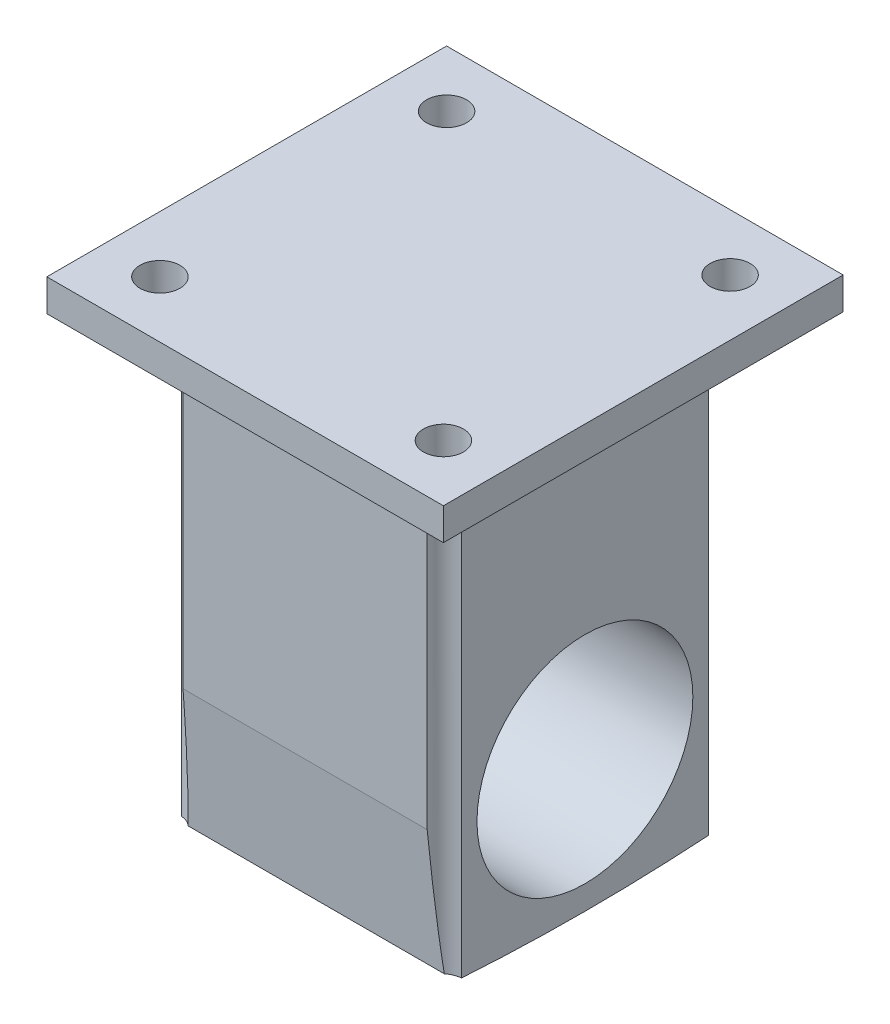
ISO-10303-21;
HEADER;
FILE_DESCRIPTION(('STEP AP214'),'2;1');
FILE_NAME('part.step','',(''),(''),'','','');
FILE_SCHEMA(('AUTOMOTIVE_DESIGN { 1 0 10303 214 1 1 1 1 }'));
ENDSEC;
DATA;
#1=APPLICATION_CONTEXT('core data for automotive mechanical design processes');
#2=APPLICATION_PROTOCOL_DEFINITION('international standard','automotive_design',2000,#1);
#3=PRODUCT_CONTEXT('',#1,'mechanical');
#4=PRODUCT('Part','Part','',(#3));
#5=PRODUCT_RELATED_PRODUCT_CATEGORY('part','',(#4));
#6=PRODUCT_DEFINITION_FORMATION('','',#4);
#7=PRODUCT_DEFINITION_CONTEXT('part definition',#1,'design');
#8=PRODUCT_DEFINITION('design','',#6,#7);
#9=PRODUCT_DEFINITION_SHAPE('','',#8);
#10=(LENGTH_UNIT() NAMED_UNIT(*) SI_UNIT(.MILLI.,.METRE.));
#11=(NAMED_UNIT(*) PLANE_ANGLE_UNIT() SI_UNIT($,.RADIAN.));
#12=(NAMED_UNIT(*) SI_UNIT($,.STERADIAN.) SOLID_ANGLE_UNIT());
#13=UNCERTAINTY_MEASURE_WITH_UNIT(LENGTH_MEASURE(1.E-05),#10,'distance_accuracy_value','');
#14=(GEOMETRIC_REPRESENTATION_CONTEXT(3) GLOBAL_UNCERTAINTY_ASSIGNED_CONTEXT((#13)) GLOBAL_UNIT_ASSIGNED_CONTEXT((#10,
#11,#12)) REPRESENTATION_CONTEXT('',''));
#15=CARTESIAN_POINT('',(0.,0.,0.));
#16=DIRECTION('',(0.,0.,1.));
#17=DIRECTION('',(1.,0.,0.));
#18=AXIS2_PLACEMENT_3D('',#15,#16,#17);
#19=CARTESIAN_POINT('',(22.225,50.292,22.225));
#20=DIRECTION('',(-1.,0.,0.));
#21=DIRECTION('',(0.,0.,1.));
#22=AXIS2_PLACEMENT_3D('',#19,#20,#21);
#23=PLANE('',#22);
#24=CARTESIAN_POINT('',(22.225,0.,0.));
#25=DIRECTION('',(1.,0.,0.));
#26=DIRECTION('',(0.,0.,-1.));
#27=AXIS2_PLACEMENT_3D('',#24,#25,#26);
#28=CIRCLE('',#27,17.145);
#29=CARTESIAN_POINT('',(22.225,0.,-17.145));
#30=VERTEX_POINT('',#29);
#31=EDGE_CURVE('E262',#30,#30,#28,.T.);
#32=ORIENTED_EDGE('',*,*,#31,.F.);
#33=EDGE_LOOP('',(#32));
#34=FACE_BOUND('',#33,.T.);
#35=CARTESIAN_POINT('',(22.225,279.047180166748,1.76941794549634E-13));
#36=DIRECTION('',(-1.,0.,0.));
#37=DIRECTION('',(0.,0.,1.));
#38=AXIS2_PLACEMENT_3D('',#35,#36,#37);
#39=CIRCLE('',#38,299.987973237435);
#40=CARTESIAN_POINT('',(22.225,-20.2992865365609,-19.6080840305499));
#41=VERTEX_POINT('',#40);
#42=CARTESIAN_POINT('',(22.225,-20.299286536561,19.60808403055));
#43=VERTEX_POINT('',#42);
#44=EDGE_CURVE('E268',#41,#43,#39,.T.);
#45=ORIENTED_EDGE('',*,*,#44,.F.);
#46=DIRECTION('',(0.,1.,0.));
#47=VECTOR('',#46,1.);
#48=CARTESIAN_POINT('',(22.225,-20.9407930706876,-19.6080840305499));
#49=LINE('',#48,#47);
#50=CARTESIAN_POINT('',(22.225,50.292,-19.6080840305499));
#51=VERTEX_POINT('',#50);
#52=EDGE_CURVE('E228',#41,#51,#49,.T.);
#53=ORIENTED_EDGE('',*,*,#52,.T.);
#54=DIRECTION('',(0.,0.,-1.));
#55=VECTOR('',#54,1.);
#56=CARTESIAN_POINT('',(22.225,50.292,22.225));
#57=LINE('',#56,#55);
#58=CARTESIAN_POINT('',(22.225,50.292,19.60808403055));
#59=VERTEX_POINT('',#58);
#60=EDGE_CURVE('E157',#59,#51,#57,.T.);
#61=ORIENTED_EDGE('',*,*,#60,.F.);
#62=DIRECTION('',(0.,1.,0.));
#63=VECTOR('',#62,1.);
#64=CARTESIAN_POINT('',(22.225,-20.9407930706876,19.60808403055));
#65=LINE('',#64,#63);
#66=EDGE_CURVE('E186',#59,#43,#65,.F.);
#67=ORIENTED_EDGE('',*,*,#66,.T.);
#68=EDGE_LOOP('',(#45,#53,#61,#67));
#69=FACE_BOUND('',#68,.T.);
#70=ADVANCED_FACE('F35',(#34,#69),#23,.F.);
#71=CARTESIAN_POINT('',(-22.225,50.292,-22.225));
#72=DIRECTION('',(0.,0.,1.));
#73=DIRECTION('',(1.,0.,0.));
#74=AXIS2_PLACEMENT_3D('',#71,#72,#73);
#75=PLANE('',#74);
#76=DIRECTION('',(-1.,0.,0.));
#77=VECTOR('',#76,1.);
#78=CARTESIAN_POINT('',(-22.225,50.292,-22.225));
#79=LINE('',#78,#77);
#80=CARTESIAN_POINT('',(19.3878245854759,50.292,-22.225));
#81=VERTEX_POINT('',#80);
#82=CARTESIAN_POINT('',(-19.387824585476,50.292,-22.225));
#83=VERTEX_POINT('',#82);
#84=EDGE_CURVE('E149',#81,#83,#79,.T.);
#85=ORIENTED_EDGE('',*,*,#84,.F.);
#86=DIRECTION('',(0.,1.,0.));
#87=VECTOR('',#86,1.);
#88=CARTESIAN_POINT('',(19.3878245854759,-20.9407930706876,-22.225));
#89=LINE('',#88,#87);
#90=CARTESIAN_POINT('',(19.3878245854759,0.,-22.225));
#91=VERTEX_POINT('',#90);
#92=EDGE_CURVE('E59',#81,#91,#89,.F.);
#93=ORIENTED_EDGE('',*,*,#92,.T.);
#94=DIRECTION('',(-1.,0.,0.));
#95=VECTOR('',#94,1.);
#96=CARTESIAN_POINT('',(-22.225,0.,-22.225));
#97=LINE('',#96,#95);
#98=CARTESIAN_POINT('',(-19.387824585476,0.,-22.225));
#99=VERTEX_POINT('',#98);
#100=EDGE_CURVE('E151',#91,#99,#97,.T.);
#101=ORIENTED_EDGE('',*,*,#100,.T.);
#102=DIRECTION('',(0.,1.,0.));
#103=VECTOR('',#102,1.);
#104=CARTESIAN_POINT('',(-19.387824585476,-20.9407930706876,-22.225));
#105=LINE('',#104,#103);
#106=EDGE_CURVE('E137',#99,#83,#105,.T.);
#107=ORIENTED_EDGE('',*,*,#106,.T.);
#108=EDGE_LOOP('',(#85,#93,#101,#107));
#109=FACE_BOUND('',#108,.T.);
#110=ADVANCED_FACE('F148',(#109),#75,.F.);
#111=CARTESIAN_POINT('',(-22.225,50.292,22.225));
#112=DIRECTION('',(1.,0.,0.));
#113=DIRECTION('',(0.,0.,-1.));
#114=AXIS2_PLACEMENT_3D('',#111,#112,#113);
#115=PLANE('',#114);
#116=CARTESIAN_POINT('',(-22.225,0.,0.));
#117=DIRECTION('',(1.,0.,0.));
#118=DIRECTION('',(0.,0.,-1.));
#119=AXIS2_PLACEMENT_3D('',#116,#117,#118);
#120=CIRCLE('',#119,17.145);
#121=CARTESIAN_POINT('',(-22.225,0.,-17.145));
#122=VERTEX_POINT('',#121);
#123=EDGE_CURVE('E38',#122,#122,#120,.T.);
#124=ORIENTED_EDGE('',*,*,#123,.T.);
#125=EDGE_LOOP('',(#124));
#126=FACE_BOUND('',#125,.T.);
#127=CARTESIAN_POINT('',(-22.225,279.047180166748,1.76941794549634E-13));
#128=DIRECTION('',(-1.,0.,0.));
#129=DIRECTION('',(0.,0.,1.));
#130=AXIS2_PLACEMENT_3D('',#127,#128,#129);
#131=CIRCLE('',#130,299.987973237435);
#132=CARTESIAN_POINT('',(-22.225,-20.2992865365609,-19.6080840305498));
#133=VERTEX_POINT('',#132);
#134=CARTESIAN_POINT('',(-22.225,-20.299286536561,19.6080840305499));
#135=VERTEX_POINT('',#134);
#136=EDGE_CURVE('E265',#133,#135,#131,.T.);
#137=ORIENTED_EDGE('',*,*,#136,.T.);
#138=DIRECTION('',(0.,1.,0.));
#139=VECTOR('',#138,1.);
#140=CARTESIAN_POINT('',(-22.225,-20.9407930706876,19.6080840305499));
#141=LINE('',#140,#139);
#142=CARTESIAN_POINT('',(-22.225,50.292,19.6080840305499));
#143=VERTEX_POINT('',#142);
#144=EDGE_CURVE('E291',#135,#143,#141,.T.);
#145=ORIENTED_EDGE('',*,*,#144,.T.);
#146=DIRECTION('',(0.,0.,1.));
#147=VECTOR('',#146,1.);
#148=CARTESIAN_POINT('',(-22.225,50.292,22.225));
#149=LINE('',#148,#147);
#150=CARTESIAN_POINT('',(-22.225,50.292,-19.6080840305498));
#151=VERTEX_POINT('',#150);
#152=EDGE_CURVE('E43',#151,#143,#149,.T.);
#153=ORIENTED_EDGE('',*,*,#152,.F.);
#154=DIRECTION('',(0.,1.,0.));
#155=VECTOR('',#154,1.);
#156=CARTESIAN_POINT('',(-22.225,-20.9407930706876,-19.6080840305498));
#157=LINE('',#156,#155);
#158=EDGE_CURVE('E51',#151,#133,#157,.F.);
#159=ORIENTED_EDGE('',*,*,#158,.T.);
#160=EDGE_LOOP('',(#137,#145,#153,#159));
#161=FACE_BOUND('',#160,.T.);
#162=ADVANCED_FACE('F297',(#126,#161),#115,.F.);
#163=CARTESIAN_POINT('',(-22.225,50.292,22.225));
#164=DIRECTION('',(0.,0.,-1.));
#165=DIRECTION('',(-1.,0.,0.));
#166=AXIS2_PLACEMENT_3D('',#163,#164,#165);
#167=PLANE('',#166);
#168=DIRECTION('',(1.,0.,0.));
#169=VECTOR('',#168,1.);
#170=CARTESIAN_POINT('',(-22.225,50.292,22.225));
#171=LINE('',#170,#169);
#172=CARTESIAN_POINT('',(-19.3878245854759,50.292,22.225));
#173=VERTEX_POINT('',#172);
#174=CARTESIAN_POINT('',(19.387824585476,50.292,22.225));
#175=VERTEX_POINT('',#174);
#176=EDGE_CURVE('E11',#173,#175,#171,.T.);
#177=ORIENTED_EDGE('',*,*,#176,.F.);
#178=DIRECTION('',(0.,1.,0.));
#179=VECTOR('',#178,1.);
#180=CARTESIAN_POINT('',(-19.3878245854759,-20.9407930706876,22.225));
#181=LINE('',#180,#179);
#182=CARTESIAN_POINT('',(-19.3878245854759,0.,22.225));
#183=VERTEX_POINT('',#182);
#184=EDGE_CURVE('E173',#173,#183,#181,.F.);
#185=ORIENTED_EDGE('',*,*,#184,.T.);
#186=DIRECTION('',(1.,0.,0.));
#187=VECTOR('',#186,1.);
#188=CARTESIAN_POINT('',(-22.225,0.,22.225));
#189=LINE('',#188,#187);
#190=CARTESIAN_POINT('',(19.387824585476,0.,22.225));
#191=VERTEX_POINT('',#190);
#192=EDGE_CURVE('E160',#183,#191,#189,.T.);
#193=ORIENTED_EDGE('',*,*,#192,.T.);
#194=DIRECTION('',(0.,1.,0.));
#195=VECTOR('',#194,1.);
#196=CARTESIAN_POINT('',(19.387824585476,-20.9407930706876,22.225));
#197=LINE('',#196,#195);
#198=EDGE_CURVE('E172',#191,#175,#197,.T.);
#199=ORIENTED_EDGE('',*,*,#198,.T.);
#200=EDGE_LOOP('',(#177,#185,#193,#199));
#201=FACE_BOUND('',#200,.T.);
#202=ADVANCED_FACE('F171',(#201),#167,.F.);
#203=CARTESIAN_POINT('',(-22.225,0.,-22.225));
#204=DIRECTION('',(0.,0.087155742747662,0.996194698091745));
#205=DIRECTION('',(0.,-0.996194698091745,0.087155742747662));
#206=AXIS2_PLACEMENT_3D('',#203,#204,#205);
#207=PLANE('',#206);
#208=ORIENTED_EDGE('',*,*,#100,.F.);
#209=CARTESIAN_POINT('',(22.5157438789308,6.22645102778873,-22.7697438789309));
#210=DIRECTION('',(0.,0.087155742747662,0.996194698091745));
#211=DIRECTION('',(0.,0.996194698091745,-0.087155742747662));
#212=AXIS2_PLACEMENT_3D('',#209,#210,#211);
#213=ELLIPSE('',#212,36.4290395550006,3.17500000000003);
#214=CARTESIAN_POINT('',(20.34366341235,-20.2426762652242,-20.4539953073674));
#215=VERTEX_POINT('',#214);
#216=EDGE_CURVE('E227',#91,#215,#213,.T.);
#217=ORIENTED_EDGE('',*,*,#216,.T.);
#218=DIRECTION('',(1.,0.,0.));
#219=VECTOR('',#218,1.);
#220=CARTESIAN_POINT('',(-22.225,-20.2426762652242,-20.4539953073676));
#221=LINE('',#220,#219);
#222=CARTESIAN_POINT('',(-20.34366341235,-20.2426762652242,-20.4539953073674));
#223=VERTEX_POINT('',#222);
#224=EDGE_CURVE('E164',#223,#215,#221,.T.);
#225=ORIENTED_EDGE('',*,*,#224,.F.);
#226=CARTESIAN_POINT('',(-22.5157438789309,6.2264510277879,-22.7697438789308));
#227=DIRECTION('',(0.,0.087155742747662,0.996194698091745));
#228=DIRECTION('',(0.,0.996194698091745,-0.087155742747662));
#229=AXIS2_PLACEMENT_3D('',#226,#227,#228);
#230=ELLIPSE('',#229,36.4290395550002,3.175);
#231=EDGE_CURVE('E279',#223,#99,#230,.T.);
#232=ORIENTED_EDGE('',*,*,#231,.T.);
#233=EDGE_LOOP('',(#208,#217,#225,#232));
#234=FACE_BOUND('',#233,.T.);
#235=ADVANCED_FACE('F278',(#234),#207,.F.);
#236=CARTESIAN_POINT('',(-22.225,279.047180166748,1.76941794549634E-13));
#237=DIRECTION('',(1.,0.,0.));
#238=DIRECTION('',(0.,0.,-1.));
#239=AXIS2_PLACEMENT_3D('',#236,#237,#238);
#240=CYLINDRICAL_SURFACE('',#239,299.987973237435);
#241=ORIENTED_EDGE('',*,*,#224,.T.);
#242=CARTESIAN_POINT('',(20.34366341235,-20.2426762652242,-20.4539953073674));
#243=CARTESIAN_POINT('',(20.409539877708,-20.2468998844398,-20.3921934044238));
#244=CARTESIAN_POINT('',(20.4780706195523,-20.250911589767,-20.3332117131913));
#245=CARTESIAN_POINT('',(20.6199181610093,-20.2584941346044,-20.2212900069011));
#246=CARTESIAN_POINT('',(20.6932347642782,-20.2620649921834,-20.1683497442333));
#247=CARTESIAN_POINT('',(20.842090187483,-20.2686584888682,-20.0702558523951));
#248=CARTESIAN_POINT('',(20.9175147677839,-20.2716933721248,-20.0249299480122));
#249=CARTESIAN_POINT('',(21.0718430967192,-20.2773168952639,-19.9406950819021));
#250=CARTESIAN_POINT('',(21.1507465986745,-20.2799055667221,-19.9017856661266));
#251=CARTESIAN_POINT('',(21.3861960706274,-20.2868177336839,-19.7976405671128));
#252=CARTESIAN_POINT('',(21.546918054512,-20.2905251367702,-19.7414327436554));
#253=CARTESIAN_POINT('',(21.7951843572114,-20.2948074715595,-19.6763561991588));
#254=CARTESIAN_POINT('',(21.8803192086161,-20.2960290428768,-19.6577577856351));
#255=CARTESIAN_POINT('',(22.0518423828956,-20.2980070442657,-19.6276127701705));
#256=CARTESIAN_POINT('',(22.1382308264445,-20.2987634292491,-19.6160668517925));
#257=CARTESIAN_POINT('',(22.225,-20.2992865365609,-19.6080840305499));
#258=B_SPLINE_CURVE_WITH_KNOTS('',3,(#242,#243,#244,#245,#246,#247,#248,#249,#250,#251,#252,
#253,#254,#255,#256,#257),.UNSPECIFIED.,.F.,.F.,(4,2,2,2,2,2,2,4),(0.,0.271191913015484,
0.542372707142449,0.806196927403615,1.07000247072561,1.57833456224518,1.83954429456216,
2.10077934061007),.UNSPECIFIED.);
#259=EDGE_CURVE('E219',#215,#41,#258,.T.);
#260=ORIENTED_EDGE('',*,*,#259,.T.);
#261=ORIENTED_EDGE('',*,*,#44,.T.);
#262=CARTESIAN_POINT('',(22.225,-20.299286536561,19.60808403055));
#263=CARTESIAN_POINT('',(22.1350072138058,-20.2987447564407,19.6163505551399));
#264=CARTESIAN_POINT('',(22.0453747452613,-20.2979503874336,19.628476958953));
#265=CARTESIAN_POINT('',(21.867478816189,-20.2958609683767,19.6603182343819));
#266=CARTESIAN_POINT('',(21.7792152800087,-20.2945659460982,19.6800326850873));
#267=CARTESIAN_POINT('',(21.6070609511576,-20.2915214885391,19.7262841903982));
#268=CARTESIAN_POINT('',(21.523116482275,-20.2897853234036,19.7526218066298));
#269=CARTESIAN_POINT('',(21.357740034913,-20.2858515382599,19.8121454335163));
#270=CARTESIAN_POINT('',(21.2763078884953,-20.283653949173,19.8453309852699));
#271=CARTESIAN_POINT('',(21.0421011617937,-20.2765453985642,19.9523536706293));
#272=CARTESIAN_POINT('',(20.8933475084751,-20.2710106450692,20.0353107007904));
#273=CARTESIAN_POINT('',(20.6798953184796,-20.2614244500721,20.1778498503013));
#274=CARTESIAN_POINT('',(20.6094891079331,-20.2579599265664,20.2291904015578));
#275=CARTESIAN_POINT('',(20.4731367268042,-20.2506217887612,20.3374722528525));
#276=CARTESIAN_POINT('',(20.4071909326343,-20.2467481400063,20.3944140245825));
#277=CARTESIAN_POINT('',(20.3436634123499,-20.2426762652242,20.4539953073676));
#278=B_SPLINE_CURVE_WITH_KNOTS('',3,(#262,#263,#264,#265,#266,#267,#268,#269,#270,#271,#272,
#273,#274,#275,#276,#277),.UNSPECIFIED.,.F.,.F.,(4,2,2,2,2,2,2,4),(0.,0.271030025770187,
0.542045019619667,0.805713195183603,1.06936370726252,1.57800741133402,1.83938227846664,
2.10077917545513),.UNSPECIFIED.);
#279=CARTESIAN_POINT('',(20.3436634123499,-20.2426762652243,20.4539953073677));
#280=VERTEX_POINT('',#279);
#281=EDGE_CURVE('E185',#43,#280,#278,.T.);
#282=ORIENTED_EDGE('',*,*,#281,.T.);
#283=DIRECTION('',(1.,0.,0.));
#284=VECTOR('',#283,1.);
#285=CARTESIAN_POINT('',(-22.225,-20.2426762652243,20.4539953073677));
#286=LINE('',#285,#284);
#287=CARTESIAN_POINT('',(-20.3436634123498,-20.2426762652243,20.4539953073677));
#288=VERTEX_POINT('',#287);
#289=EDGE_CURVE('E182',#288,#280,#286,.T.);
#290=ORIENTED_EDGE('',*,*,#289,.F.);
#291=CARTESIAN_POINT('',(-20.3436634123498,-20.2426762652242,20.4539953073676));
#292=CARTESIAN_POINT('',(-20.4095398777078,-20.2468998844398,20.392193404424));
#293=CARTESIAN_POINT('',(-20.4780706195521,-20.250911589767,20.3332117131915));
#294=CARTESIAN_POINT('',(-20.6199181610091,-20.2584941346044,20.2212900069012));
#295=CARTESIAN_POINT('',(-20.693234764278,-20.2620649921834,20.1683497442335));
#296=CARTESIAN_POINT('',(-20.8420901874828,-20.2686584888682,20.0702558523952));
#297=CARTESIAN_POINT('',(-20.9175147677836,-20.2716933721248,20.0249299480124));
#298=CARTESIAN_POINT('',(-21.0718430967189,-20.2773168952639,19.9406950819023));
#299=CARTESIAN_POINT('',(-21.1507465986742,-20.2799055667222,19.9017856661268));
#300=CARTESIAN_POINT('',(-21.3861960706272,-20.2868177336839,19.7976405671129));
#301=CARTESIAN_POINT('',(-21.5469180545118,-20.2905251367703,19.7414327436555));
#302=CARTESIAN_POINT('',(-21.7951843572113,-20.2948074715595,19.6763561991589));
#303=CARTESIAN_POINT('',(-21.880319208616,-20.2960290428769,19.6577577856352));
#304=CARTESIAN_POINT('',(-22.0518423828956,-20.2980070442657,19.6276127701706));
#305=CARTESIAN_POINT('',(-22.1382308264444,-20.2987634292491,19.6160668517926));
#306=CARTESIAN_POINT('',(-22.225,-20.2992865365609,19.6080840305499));
#307=B_SPLINE_CURVE_WITH_KNOTS('',3,(#291,#292,#293,#294,#295,#296,#297,#298,#299,#300,#301,
#302,#303,#304,#305,#306),.UNSPECIFIED.,.F.,.F.,(4,2,2,2,2,2,2,4),(0.,0.271191913015483,
0.542372707142445,0.806196927403611,1.07000247072561,1.5783345622453,1.83954429456234,
2.10077934061033),.UNSPECIFIED.);
#308=EDGE_CURVE('E281',#288,#135,#307,.T.);
#309=ORIENTED_EDGE('',*,*,#308,.T.);
#310=ORIENTED_EDGE('',*,*,#136,.F.);
#311=CARTESIAN_POINT('',(-22.225,-20.2992865365609,-19.6080840305498));
#312=CARTESIAN_POINT('',(-22.1350072138058,-20.2987447564406,-19.6163505551398));
#313=CARTESIAN_POINT('',(-22.0453747452613,-20.2979503874336,-19.6284769589529));
#314=CARTESIAN_POINT('',(-21.867478816189,-20.2958609683766,-19.6603182343817));
#315=CARTESIAN_POINT('',(-21.7792152800087,-20.2945659460981,-19.6800326850872));
#316=CARTESIAN_POINT('',(-21.6070609511576,-20.291521488539,-19.7262841903981));
#317=CARTESIAN_POINT('',(-21.523116482275,-20.2897853234035,-19.7526218066297));
#318=CARTESIAN_POINT('',(-21.357740034913,-20.2858515382598,-19.8121454335162));
#319=CARTESIAN_POINT('',(-21.2763078884953,-20.283653949173,-19.8453309852698));
#320=CARTESIAN_POINT('',(-21.0421011617937,-20.2765453985642,-19.9523536706292));
#321=CARTESIAN_POINT('',(-20.8933475084751,-20.2710106450692,-20.0353107007902));
#322=CARTESIAN_POINT('',(-20.6798953184797,-20.261424450072,-20.1778498503011));
#323=CARTESIAN_POINT('',(-20.6094891079332,-20.2579599265664,-20.2291904015576));
#324=CARTESIAN_POINT('',(-20.4731367268043,-20.2506217887612,-20.3374722528524));
#325=CARTESIAN_POINT('',(-20.4071909326344,-20.2467481400062,-20.3944140245823));
#326=CARTESIAN_POINT('',(-20.34366341235,-20.2426762652242,-20.4539953073674));
#327=B_SPLINE_CURVE_WITH_KNOTS('',3,(#311,#312,#313,#314,#315,#316,#317,#318,#319,#320,#321,
#322,#323,#324,#325,#326),.UNSPECIFIED.,.F.,.F.,(4,2,2,2,2,2,2,4),(0.,0.271030025770193,
0.542045019619682,0.805713195183629,1.06936370726254,1.57800741133397,1.83938227846656,
2.100779175455),.UNSPECIFIED.);
#328=EDGE_CURVE('E152',#133,#223,#327,.T.);
#329=ORIENTED_EDGE('',*,*,#328,.T.);
#330=EDGE_LOOP('',(#241,#260,#261,#282,#290,#309,#310,#329));
#331=FACE_BOUND('',#330,.T.);
#332=ADVANCED_FACE('F201',(#331),#240,.T.);
#333=CARTESIAN_POINT('',(-22.225,0.,22.225));
#334=DIRECTION('',(0.,-0.0871557427476548,0.996194698091746));
#335=DIRECTION('',(0.,-0.996194698091746,-0.0871557427476549));
#336=AXIS2_PLACEMENT_3D('',#333,#334,#335);
#337=PLANE('',#336);
#338=CARTESIAN_POINT('',(-22.5157438789308,6.22645102778945,22.7697438789309));
#339=DIRECTION('',(0.,-0.0871557427476548,0.996194698091746));
#340=DIRECTION('',(0.,0.996194698091746,0.0871557427476549));
#341=AXIS2_PLACEMENT_3D('',#338,#339,#340);
#342=ELLIPSE('',#341,36.4290395550034,3.17500000000002);
#343=EDGE_CURVE('E179',#288,#183,#342,.T.);
#344=ORIENTED_EDGE('',*,*,#343,.F.);
#345=ORIENTED_EDGE('',*,*,#289,.T.);
#346=CARTESIAN_POINT('',(22.5157438789309,6.2264510277887,22.7697438789308));
#347=DIRECTION('',(0.,-0.0871557427476548,0.996194698091746));
#348=DIRECTION('',(0.,0.996194698091746,0.0871557427476549));
#349=AXIS2_PLACEMENT_3D('',#346,#347,#348);
#350=ELLIPSE('',#349,36.4290395550023,3.17499999999993);
#351=EDGE_CURVE('E181',#191,#280,#350,.T.);
#352=ORIENTED_EDGE('',*,*,#351,.F.);
#353=ORIENTED_EDGE('',*,*,#192,.F.);
#354=EDGE_LOOP('',(#344,#345,#352,#353));
#355=FACE_BOUND('',#354,.T.);
#356=ADVANCED_FACE('F177',(#355),#337,.T.);
#357=CARTESIAN_POINT('',(-104.775,0.,0.));
#358=DIRECTION('',(1.,0.,0.));
#359=DIRECTION('',(0.,0.,-1.));
#360=AXIS2_PLACEMENT_3D('',#357,#358,#359);
#361=CYLINDRICAL_SURFACE('',#360,17.145);
#362=ORIENTED_EDGE('',*,*,#31,.T.);
#363=EDGE_LOOP('',(#362));
#364=FACE_BOUND('',#363,.T.);
#365=ORIENTED_EDGE('',*,*,#123,.F.);
#366=EDGE_LOOP('',(#365));
#367=FACE_BOUND('',#366,.T.);
#368=ADVANCED_FACE('F321',(#364,#367),#361,.F.);
#369=CARTESIAN_POINT('',(0.,50.292,0.));
#370=DIRECTION('',(0.,1.,0.));
#371=DIRECTION('',(0.,0.,1.));
#372=AXIS2_PLACEMENT_3D('',#369,#370,#371);
#373=PLANE('',#372);
#374=DIRECTION('',(0.,0.,1.));
#375=VECTOR('',#374,1.);
#376=CARTESIAN_POINT('',(-31.496,50.292,31.75));
#377=LINE('',#376,#375);
#378=CARTESIAN_POINT('',(-31.496,50.292,-31.75));
#379=VERTEX_POINT('',#378);
#380=CARTESIAN_POINT('',(-31.496,50.292,31.75));
#381=VERTEX_POINT('',#380);
#382=EDGE_CURVE('E232',#379,#381,#377,.T.);
#383=ORIENTED_EDGE('',*,*,#382,.F.);
#384=DIRECTION('',(-1.,0.,0.));
#385=VECTOR('',#384,1.);
#386=CARTESIAN_POINT('',(31.496,50.292,-31.75));
#387=LINE('',#386,#385);
#388=CARTESIAN_POINT('',(31.496,50.292,-31.75));
#389=VERTEX_POINT('',#388);
#390=EDGE_CURVE('E237',#389,#379,#387,.T.);
#391=ORIENTED_EDGE('',*,*,#390,.F.);
#392=DIRECTION('',(0.,0.,-1.));
#393=VECTOR('',#392,1.);
#394=CARTESIAN_POINT('',(31.496,50.292,31.75));
#395=LINE('',#394,#393);
#396=CARTESIAN_POINT('',(31.496,50.292,31.75));
#397=VERTEX_POINT('',#396);
#398=EDGE_CURVE('E248',#397,#389,#395,.T.);
#399=ORIENTED_EDGE('',*,*,#398,.F.);
#400=DIRECTION('',(1.,0.,0.));
#401=VECTOR('',#400,1.);
#402=CARTESIAN_POINT('',(31.496,50.292,31.75));
#403=LINE('',#402,#401);
#404=EDGE_CURVE('E246',#381,#397,#403,.T.);
#405=ORIENTED_EDGE('',*,*,#404,.F.);
#406=EDGE_LOOP('',(#383,#391,#399,#405));
#407=FACE_BOUND('',#406,.T.);
#408=ORIENTED_EDGE('',*,*,#60,.T.);
#409=CARTESIAN_POINT('',(22.5157438789308,50.292,-22.7697438789309));
#410=DIRECTION('',(0.,1.,0.));
#411=DIRECTION('',(0.,0.,1.));
#412=AXIS2_PLACEMENT_3D('',#409,#410,#411);
#413=CIRCLE('',#412,3.17500000000003);
#414=EDGE_CURVE('E156',#51,#81,#413,.T.);
#415=ORIENTED_EDGE('',*,*,#414,.T.);
#416=ORIENTED_EDGE('',*,*,#84,.T.);
#417=CARTESIAN_POINT('',(-22.5157438789309,50.292,-22.7697438789308));
#418=DIRECTION('',(0.,1.,0.));
#419=DIRECTION('',(0.,0.,1.));
#420=AXIS2_PLACEMENT_3D('',#417,#418,#419);
#421=CIRCLE('',#420,3.175);
#422=EDGE_CURVE('E134',#83,#151,#421,.T.);
#423=ORIENTED_EDGE('',*,*,#422,.T.);
#424=ORIENTED_EDGE('',*,*,#152,.T.);
#425=CARTESIAN_POINT('',(-22.5157438789308,50.292,22.7697438789309));
#426=DIRECTION('',(0.,1.,0.));
#427=DIRECTION('',(0.,0.,1.));
#428=AXIS2_PLACEMENT_3D('',#425,#426,#427);
#429=CIRCLE('',#428,3.17500000000002);
#430=EDGE_CURVE('E188',#143,#173,#429,.T.);
#431=ORIENTED_EDGE('',*,*,#430,.T.);
#432=ORIENTED_EDGE('',*,*,#176,.T.);
#433=CARTESIAN_POINT('',(22.5157438789309,50.292,22.7697438789308));
#434=DIRECTION('',(0.,1.,0.));
#435=DIRECTION('',(0.,0.,1.));
#436=AXIS2_PLACEMENT_3D('',#433,#434,#435);
#437=CIRCLE('',#436,3.17499999999993);
#438=EDGE_CURVE('E300',#175,#59,#437,.T.);
#439=ORIENTED_EDGE('',*,*,#438,.T.);
#440=EDGE_LOOP('',(#408,#415,#416,#423,#424,#431,#432,#439));
#441=FACE_BOUND('',#440,.T.);
#442=ADVANCED_FACE('F155',(#407,#441),#373,.F.);
#443=CARTESIAN_POINT('',(-31.496,55.372,31.75));
#444=DIRECTION('',(1.,0.,0.));
#445=DIRECTION('',(0.,0.,-1.));
#446=AXIS2_PLACEMENT_3D('',#443,#444,#445);
#447=PLANE('',#446);
#448=ORIENTED_EDGE('',*,*,#382,.T.);
#449=DIRECTION('',(0.,-1.,0.));
#450=VECTOR('',#449,1.);
#451=CARTESIAN_POINT('',(-31.496,55.372,31.75));
#452=LINE('',#451,#450);
#453=CARTESIAN_POINT('',(-31.496,55.372,31.75));
#454=VERTEX_POINT('',#453);
#455=EDGE_CURVE('E259',#454,#381,#452,.T.);
#456=ORIENTED_EDGE('',*,*,#455,.F.);
#457=DIRECTION('',(0.,0.,1.));
#458=VECTOR('',#457,1.);
#459=CARTESIAN_POINT('',(-31.496,55.372,31.75));
#460=LINE('',#459,#458);
#461=CARTESIAN_POINT('',(-31.496,55.372,-31.75));
#462=VERTEX_POINT('',#461);
#463=EDGE_CURVE('E233',#462,#454,#460,.T.);
#464=ORIENTED_EDGE('',*,*,#463,.F.);
#465=DIRECTION('',(0.,-1.,0.));
#466=VECTOR('',#465,1.);
#467=CARTESIAN_POINT('',(-31.496,55.372,-31.75));
#468=LINE('',#467,#466);
#469=EDGE_CURVE('E243',#462,#379,#468,.T.);
#470=ORIENTED_EDGE('',*,*,#469,.T.);
#471=EDGE_LOOP('',(#448,#456,#464,#470));
#472=FACE_BOUND('',#471,.T.);
#473=ADVANCED_FACE('F320',(#472),#447,.F.);
#474=CARTESIAN_POINT('',(31.496,55.372,31.75));
#475=DIRECTION('',(0.,0.,-1.));
#476=DIRECTION('',(-1.,0.,0.));
#477=AXIS2_PLACEMENT_3D('',#474,#475,#476);
#478=PLANE('',#477);
#479=ORIENTED_EDGE('',*,*,#404,.T.);
#480=DIRECTION('',(0.,-1.,0.));
#481=VECTOR('',#480,1.);
#482=CARTESIAN_POINT('',(31.496,55.372,31.75));
#483=LINE('',#482,#481);
#484=CARTESIAN_POINT('',(31.496,55.372,31.75));
#485=VERTEX_POINT('',#484);
#486=EDGE_CURVE('E256',#485,#397,#483,.T.);
#487=ORIENTED_EDGE('',*,*,#486,.F.);
#488=DIRECTION('',(1.,0.,0.));
#489=VECTOR('',#488,1.);
#490=CARTESIAN_POINT('',(31.496,55.372,31.75));
#491=LINE('',#490,#489);
#492=EDGE_CURVE('E236',#454,#485,#491,.T.);
#493=ORIENTED_EDGE('',*,*,#492,.F.);
#494=ORIENTED_EDGE('',*,*,#455,.T.);
#495=EDGE_LOOP('',(#479,#487,#493,#494));
#496=FACE_BOUND('',#495,.T.);
#497=ADVANCED_FACE('F329',(#496),#478,.F.);
#498=CARTESIAN_POINT('',(31.496,55.372,31.75));
#499=DIRECTION('',(-1.,0.,0.));
#500=DIRECTION('',(0.,0.,1.));
#501=AXIS2_PLACEMENT_3D('',#498,#499,#500);
#502=PLANE('',#501);
#503=ORIENTED_EDGE('',*,*,#398,.T.);
#504=DIRECTION('',(0.,-1.,0.));
#505=VECTOR('',#504,1.);
#506=CARTESIAN_POINT('',(31.496,55.372,-31.75));
#507=LINE('',#506,#505);
#508=CARTESIAN_POINT('',(31.496,55.372,-31.75));
#509=VERTEX_POINT('',#508);
#510=EDGE_CURVE('E253',#509,#389,#507,.T.);
#511=ORIENTED_EDGE('',*,*,#510,.F.);
#512=DIRECTION('',(0.,0.,-1.));
#513=VECTOR('',#512,1.);
#514=CARTESIAN_POINT('',(31.496,55.372,31.75));
#515=LINE('',#514,#513);
#516=EDGE_CURVE('E239',#485,#509,#515,.T.);
#517=ORIENTED_EDGE('',*,*,#516,.F.);
#518=ORIENTED_EDGE('',*,*,#486,.T.);
#519=EDGE_LOOP('',(#503,#511,#517,#518));
#520=FACE_BOUND('',#519,.T.);
#521=ADVANCED_FACE('F325',(#520),#502,.F.);
#522=CARTESIAN_POINT('',(31.496,55.372,-31.75));
#523=DIRECTION('',(0.,0.,1.));
#524=DIRECTION('',(1.,0.,0.));
#525=AXIS2_PLACEMENT_3D('',#522,#523,#524);
#526=PLANE('',#525);
#527=ORIENTED_EDGE('',*,*,#390,.T.);
#528=ORIENTED_EDGE('',*,*,#469,.F.);
#529=DIRECTION('',(-1.,0.,0.));
#530=VECTOR('',#529,1.);
#531=CARTESIAN_POINT('',(31.496,55.372,-31.75));
#532=LINE('',#531,#530);
#533=EDGE_CURVE('E241',#509,#462,#532,.T.);
#534=ORIENTED_EDGE('',*,*,#533,.F.);
#535=ORIENTED_EDGE('',*,*,#510,.T.);
#536=EDGE_LOOP('',(#527,#528,#534,#535));
#537=FACE_BOUND('',#536,.T.);
#538=ADVANCED_FACE('F316',(#537),#526,.F.);
#539=CARTESIAN_POINT('',(0.,55.372,0.));
#540=DIRECTION('',(0.,1.,0.));
#541=DIRECTION('',(0.,0.,1.));
#542=AXIS2_PLACEMENT_3D('',#539,#540,#541);
#543=PLANE('',#542);
#544=CARTESIAN_POINT('',(22.5157438789308,55.372,-22.7697438789309));
#545=DIRECTION('',(0.,1.,0.));
#546=DIRECTION('',(0.,0.,1.));
#547=AXIS2_PLACEMENT_3D('',#544,#545,#546);
#548=CIRCLE('',#547,3.17500000000003);
#549=CARTESIAN_POINT('',(22.5157438789308,55.372,-19.5947438789308));
#550=VERTEX_POINT('',#549);
#551=EDGE_CURVE('E421',#550,#550,#548,.T.);
#552=ORIENTED_EDGE('',*,*,#551,.F.);
#553=EDGE_LOOP('',(#552));
#554=FACE_BOUND('',#553,.T.);
#555=CARTESIAN_POINT('',(-22.5157438789308,55.372,22.7697438789309));
#556=DIRECTION('',(0.,1.,0.));
#557=DIRECTION('',(0.,0.,-1.));
#558=AXIS2_PLACEMENT_3D('',#555,#556,#557);
#559=CIRCLE('',#558,3.17500000000002);
#560=CARTESIAN_POINT('',(-22.5157438789308,55.372,19.5947438789309));
#561=VERTEX_POINT('',#560);
#562=EDGE_CURVE('E419',#561,#561,#559,.T.);
#563=ORIENTED_EDGE('',*,*,#562,.F.);
#564=EDGE_LOOP('',(#563));
#565=FACE_BOUND('',#564,.T.);
#566=CARTESIAN_POINT('',(22.5157438789309,55.372,22.7697438789308));
#567=DIRECTION('',(0.,1.,0.));
#568=DIRECTION('',(0.,0.,-1.));
#569=AXIS2_PLACEMENT_3D('',#566,#567,#568);
#570=CIRCLE('',#569,3.17499999999993);
#571=CARTESIAN_POINT('',(22.5157438789309,55.372,19.5947438789309));
#572=VERTEX_POINT('',#571);
#573=EDGE_CURVE('E422',#572,#572,#570,.T.);
#574=ORIENTED_EDGE('',*,*,#573,.F.);
#575=EDGE_LOOP('',(#574));
#576=FACE_BOUND('',#575,.T.);
#577=CARTESIAN_POINT('',(-22.5157438789309,55.372,-22.7697438789308));
#578=DIRECTION('',(0.,1.,0.));
#579=DIRECTION('',(0.,0.,1.));
#580=AXIS2_PLACEMENT_3D('',#577,#578,#579);
#581=CIRCLE('',#580,3.175);
#582=CARTESIAN_POINT('',(-22.5157438789309,55.372,-19.5947438789308));
#583=VERTEX_POINT('',#582);
#584=EDGE_CURVE('E143',#583,#583,#581,.T.);
#585=ORIENTED_EDGE('',*,*,#584,.F.);
#586=EDGE_LOOP('',(#585));
#587=FACE_BOUND('',#586,.T.);
#588=ORIENTED_EDGE('',*,*,#463,.T.);
#589=ORIENTED_EDGE('',*,*,#492,.T.);
#590=ORIENTED_EDGE('',*,*,#516,.T.);
#591=ORIENTED_EDGE('',*,*,#533,.T.);
#592=EDGE_LOOP('',(#588,#589,#590,#591));
#593=FACE_BOUND('',#592,.T.);
#594=ADVANCED_FACE('F312',(#554,#565,#576,#587,#593),#543,.T.);
#595=CARTESIAN_POINT('',(-22.5157438789309,-20.9407930706876,-22.7697438789308));
#596=DIRECTION('',(0.,1.,0.));
#597=DIRECTION('',(0.,0.,1.));
#598=AXIS2_PLACEMENT_3D('',#595,#596,#597);
#599=CYLINDRICAL_SURFACE('',#598,3.175);
#600=ORIENTED_EDGE('',*,*,#584,.T.);
#601=EDGE_LOOP('',(#600));
#602=FACE_BOUND('',#601,.T.);
#603=ORIENTED_EDGE('',*,*,#328,.F.);
#604=ORIENTED_EDGE('',*,*,#158,.F.);
#605=ORIENTED_EDGE('',*,*,#422,.F.);
#606=ORIENTED_EDGE('',*,*,#106,.F.);
#607=ORIENTED_EDGE('',*,*,#231,.F.);
#608=EDGE_LOOP('',(#603,#604,#605,#606,#607));
#609=FACE_BOUND('',#608,.T.);
#610=ADVANCED_FACE('F136',(#602,#609),#599,.F.);
#611=CARTESIAN_POINT('',(22.5157438789309,-20.9407930706876,22.7697438789308));
#612=DIRECTION('',(0.,1.,0.));
#613=DIRECTION('',(0.,0.,1.));
#614=AXIS2_PLACEMENT_3D('',#611,#612,#613);
#615=CYLINDRICAL_SURFACE('',#614,3.17499999999993);
#616=ORIENTED_EDGE('',*,*,#573,.T.);
#617=EDGE_LOOP('',(#616));
#618=FACE_BOUND('',#617,.T.);
#619=ORIENTED_EDGE('',*,*,#66,.F.);
#620=ORIENTED_EDGE('',*,*,#438,.F.);
#621=ORIENTED_EDGE('',*,*,#198,.F.);
#622=ORIENTED_EDGE('',*,*,#351,.T.);
#623=ORIENTED_EDGE('',*,*,#281,.F.);
#624=EDGE_LOOP('',(#619,#620,#621,#622,#623));
#625=FACE_BOUND('',#624,.T.);
#626=ADVANCED_FACE('F205',(#618,#625),#615,.F.);
#627=CARTESIAN_POINT('',(-22.5157438789308,-20.9407930706876,22.7697438789309));
#628=DIRECTION('',(0.,1.,0.));
#629=DIRECTION('',(0.,0.,1.));
#630=AXIS2_PLACEMENT_3D('',#627,#628,#629);
#631=CYLINDRICAL_SURFACE('',#630,3.17500000000002);
#632=ORIENTED_EDGE('',*,*,#562,.T.);
#633=EDGE_LOOP('',(#632));
#634=FACE_BOUND('',#633,.T.);
#635=ORIENTED_EDGE('',*,*,#343,.T.);
#636=ORIENTED_EDGE('',*,*,#184,.F.);
#637=ORIENTED_EDGE('',*,*,#430,.F.);
#638=ORIENTED_EDGE('',*,*,#144,.F.);
#639=ORIENTED_EDGE('',*,*,#308,.F.);
#640=EDGE_LOOP('',(#635,#636,#637,#638,#639));
#641=FACE_BOUND('',#640,.T.);
#642=ADVANCED_FACE('F209',(#634,#641),#631,.F.);
#643=CARTESIAN_POINT('',(22.5157438789308,-20.9407930706876,-22.7697438789309));
#644=DIRECTION('',(0.,1.,0.));
#645=DIRECTION('',(0.,0.,1.));
#646=AXIS2_PLACEMENT_3D('',#643,#644,#645);
#647=CYLINDRICAL_SURFACE('',#646,3.17500000000003);
#648=ORIENTED_EDGE('',*,*,#551,.T.);
#649=EDGE_LOOP('',(#648));
#650=FACE_BOUND('',#649,.T.);
#651=ORIENTED_EDGE('',*,*,#92,.F.);
#652=ORIENTED_EDGE('',*,*,#414,.F.);
#653=ORIENTED_EDGE('',*,*,#52,.F.);
#654=ORIENTED_EDGE('',*,*,#259,.F.);
#655=ORIENTED_EDGE('',*,*,#216,.F.);
#656=EDGE_LOOP('',(#651,#652,#653,#654,#655));
#657=FACE_BOUND('',#656,.T.);
#658=ADVANCED_FACE('F211',(#650,#657),#647,.F.);
#659=CLOSED_SHELL('',(#70,#110,#162,#202,#235,#332,#356,#368,#442,#473,#497,#521,#538,#594,#610,
#626,#642,#658));
#660=MANIFOLD_SOLID_BREP('B2',#659);
#661=ADVANCED_BREP_SHAPE_REPRESENTATION('',(#18,#660),#14);
#662=SHAPE_DEFINITION_REPRESENTATION(#9,#661);
ENDSEC;
END-ISO-10303-21;
